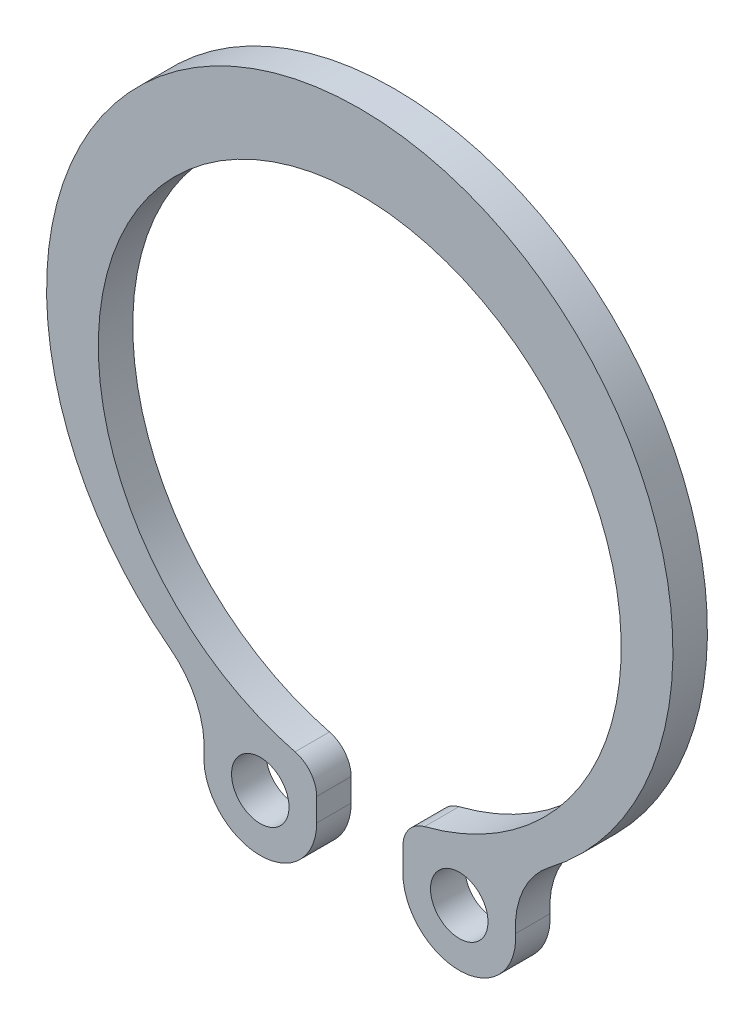
ISO-10303-21;
HEADER;
FILE_DESCRIPTION(('STEP AP214'),'2;1');
FILE_NAME('part.step','',(''),(''),'','','');
FILE_SCHEMA(('AUTOMOTIVE_DESIGN { 1 0 10303 214 1 1 1 1 }'));
ENDSEC;
DATA;
#1=APPLICATION_CONTEXT('core data for automotive mechanical design processes');
#2=APPLICATION_PROTOCOL_DEFINITION('international standard','automotive_design',2000,#1);
#3=PRODUCT_CONTEXT('',#1,'mechanical');
#4=PRODUCT('Part','Part','',(#3));
#5=PRODUCT_RELATED_PRODUCT_CATEGORY('part','',(#4));
#6=PRODUCT_DEFINITION_FORMATION('','',#4);
#7=PRODUCT_DEFINITION_CONTEXT('part definition',#1,'design');
#8=PRODUCT_DEFINITION('design','',#6,#7);
#9=PRODUCT_DEFINITION_SHAPE('','',#8);
#10=(LENGTH_UNIT() NAMED_UNIT(*) SI_UNIT(.MILLI.,.METRE.));
#11=(NAMED_UNIT(*) PLANE_ANGLE_UNIT() SI_UNIT($,.RADIAN.));
#12=(NAMED_UNIT(*) SI_UNIT($,.STERADIAN.) SOLID_ANGLE_UNIT());
#13=UNCERTAINTY_MEASURE_WITH_UNIT(LENGTH_MEASURE(1.E-05),#10,'distance_accuracy_value','');
#14=(GEOMETRIC_REPRESENTATION_CONTEXT(3) GLOBAL_UNCERTAINTY_ASSIGNED_CONTEXT((#13)) GLOBAL_UNIT_ASSIGNED_CONTEXT((#10,
#11,#12)) REPRESENTATION_CONTEXT('',''));
#15=CARTESIAN_POINT('',(0.,0.,0.));
#16=DIRECTION('',(0.,0.,1.));
#17=DIRECTION('',(1.,0.,0.));
#18=AXIS2_PLACEMENT_3D('',#15,#16,#17);
#19=CARTESIAN_POINT('',(2.5,-10.5857038581801,1.2));
#20=DIRECTION('',(0.,0.,1.));
#21=DIRECTION('',(1.,0.,0.));
#22=AXIS2_PLACEMENT_3D('',#19,#20,#21);
#23=PLANE('',#22);
#24=CARTESIAN_POINT('',(-3.46294408179002,-11.384990921665,1.2));
#25=DIRECTION('',(0.,0.,1.));
#26=DIRECTION('',(1.,0.,0.));
#27=AXIS2_PLACEMENT_3D('',#24,#25,#26);
#28=CIRCLE('',#27,1.);
#29=CARTESIAN_POINT('',(-2.46294408179002,-11.384990921665,1.2));
#30=VERTEX_POINT('',#29);
#31=EDGE_CURVE('E148',#30,#30,#28,.T.);
#32=ORIENTED_EDGE('',*,*,#31,.F.);
#33=EDGE_LOOP('',(#32));
#34=FACE_BOUND('',#33,.T.);
#35=CARTESIAN_POINT('',(2.5,-10.5857038581801,1.2));
#36=DIRECTION('',(0.,0.,1.));
#37=DIRECTION('',(1.,0.,0.));
#38=AXIS2_PLACEMENT_3D('',#35,#36,#37);
#39=CIRCLE('',#38,1.);
#40=CARTESIAN_POINT('',(2.25247524752475,-9.61682228806322,1.2));
#41=VERTEX_POINT('',#40);
#42=CARTESIAN_POINT('',(1.5,-10.5857038581801,1.2));
#43=VERTEX_POINT('',#42);
#44=EDGE_CURVE('E163',#41,#43,#39,.T.);
#45=ORIENTED_EDGE('',*,*,#44,.T.);
#46=DIRECTION('',(0.,-1.,0.));
#47=VECTOR('',#46,1.);
#48=CARTESIAN_POINT('',(1.5,-11.384990921665,1.2));
#49=LINE('',#48,#47);
#50=CARTESIAN_POINT('',(1.5,-11.384990921665,1.2));
#51=VERTEX_POINT('',#50);
#52=EDGE_CURVE('E101',#43,#51,#49,.T.);
#53=ORIENTED_EDGE('',*,*,#52,.T.);
#54=CARTESIAN_POINT('',(3.46294408179002,-11.384990921665,1.2));
#55=DIRECTION('',(0.,0.,1.));
#56=DIRECTION('',(-1.,0.,0.));
#57=AXIS2_PLACEMENT_3D('',#54,#55,#56);
#58=CIRCLE('',#57,1.96294408179002);
#59=CARTESIAN_POINT('',(5.42175310410235,-11.2576461834845,1.2));
#60=VERTEX_POINT('',#59);
#61=EDGE_CURVE('E184',#51,#60,#58,.T.);
#62=ORIENTED_EDGE('',*,*,#61,.T.);
#63=CARTESIAN_POINT('',(8.41543342411343,-11.063023107827,1.2));
#64=DIRECTION('',(0.,0.,-1.));
#65=DIRECTION('',(1.,0.,0.));
#66=AXIS2_PLACEMENT_3D('',#63,#64,#65);
#67=CIRCLE('',#66,3.);
#68=CARTESIAN_POINT('',(6.59915282898103,-8.6753202787996,1.2));
#69=VERTEX_POINT('',#68);
#70=EDGE_CURVE('E203',#60,#69,#67,.T.);
#71=ORIENTED_EDGE('',*,*,#70,.T.);
#72=CARTESIAN_POINT('',(0.,0.,1.2));
#73=DIRECTION('',(0.,0.,1.));
#74=DIRECTION('',(1.,0.,0.));
#75=AXIS2_PLACEMENT_3D('',#72,#73,#74);
#76=CIRCLE('',#75,10.9);
#77=CARTESIAN_POINT('',(-6.59915282898103,-8.6753202787996,1.2));
#78=VERTEX_POINT('',#77);
#79=EDGE_CURVE('E200',#69,#78,#76,.T.);
#80=ORIENTED_EDGE('',*,*,#79,.T.);
#81=CARTESIAN_POINT('',(-8.41543342411343,-11.063023107827,1.2));
#82=DIRECTION('',(0.,0.,-1.));
#83=DIRECTION('',(-1.,0.,0.));
#84=AXIS2_PLACEMENT_3D('',#81,#82,#83);
#85=CIRCLE('',#84,3.);
#86=CARTESIAN_POINT('',(-5.42175310410235,-11.2576461834845,1.2));
#87=VERTEX_POINT('',#86);
#88=EDGE_CURVE('E202',#78,#87,#85,.T.);
#89=ORIENTED_EDGE('',*,*,#88,.T.);
#90=CARTESIAN_POINT('',(-3.46294408179002,-11.384990921665,1.2));
#91=DIRECTION('',(0.,0.,1.));
#92=DIRECTION('',(1.,0.,0.));
#93=AXIS2_PLACEMENT_3D('',#90,#91,#92);
#94=CIRCLE('',#93,1.96294408179002);
#95=CARTESIAN_POINT('',(-1.5,-11.384990921665,1.2));
#96=VERTEX_POINT('',#95);
#97=EDGE_CURVE('E126',#87,#96,#94,.T.);
#98=ORIENTED_EDGE('',*,*,#97,.T.);
#99=DIRECTION('',(0.,1.,0.));
#100=VECTOR('',#99,1.);
#101=CARTESIAN_POINT('',(-1.5,-11.384990921665,1.2));
#102=LINE('',#101,#100);
#103=CARTESIAN_POINT('',(-1.5,-10.5857038581801,1.2));
#104=VERTEX_POINT('',#103);
#105=EDGE_CURVE('E120',#96,#104,#102,.T.);
#106=ORIENTED_EDGE('',*,*,#105,.T.);
#107=CARTESIAN_POINT('',(-2.5,-10.5857038581801,1.2));
#108=DIRECTION('',(0.,0.,1.));
#109=DIRECTION('',(-1.,0.,0.));
#110=AXIS2_PLACEMENT_3D('',#107,#108,#109);
#111=CIRCLE('',#110,1.);
#112=CARTESIAN_POINT('',(-2.25247524752476,-9.61682228806322,1.2));
#113=VERTEX_POINT('',#112);
#114=EDGE_CURVE('E124',#104,#113,#111,.T.);
#115=ORIENTED_EDGE('',*,*,#114,.T.);
#116=CARTESIAN_POINT('',(0.,-0.8,1.2));
#117=DIRECTION('',(0.,0.,-1.));
#118=DIRECTION('',(1.,0.,0.));
#119=AXIS2_PLACEMENT_3D('',#116,#117,#118);
#120=CIRCLE('',#119,9.1);
#121=EDGE_CURVE('E52',#113,#41,#120,.T.);
#122=ORIENTED_EDGE('',*,*,#121,.T.);
#123=EDGE_LOOP('',(#45,#53,#62,#71,#80,#89,#98,#106,#115,#122));
#124=FACE_BOUND('',#123,.T.);
#125=CARTESIAN_POINT('',(3.46294408179002,-11.384990921665,1.2));
#126=DIRECTION('',(0.,0.,1.));
#127=DIRECTION('',(-1.,0.,0.));
#128=AXIS2_PLACEMENT_3D('',#125,#126,#127);
#129=CIRCLE('',#128,0.999999999999999);
#130=CARTESIAN_POINT('',(2.46294408179002,-11.384990921665,1.2));
#131=VERTEX_POINT('',#130);
#132=EDGE_CURVE('E214',#131,#131,#129,.T.);
#133=ORIENTED_EDGE('',*,*,#132,.F.);
#134=EDGE_LOOP('',(#133));
#135=FACE_BOUND('',#134,.T.);
#136=ADVANCED_FACE('F35',(#34,#124,#135),#23,.T.);
#137=CARTESIAN_POINT('',(2.5,-10.5857038581801,0.));
#138=DIRECTION('',(0.,0.,1.));
#139=DIRECTION('',(1.,0.,0.));
#140=AXIS2_PLACEMENT_3D('',#137,#138,#139);
#141=PLANE('',#140);
#142=CARTESIAN_POINT('',(2.5,-10.5857038581801,0.));
#143=DIRECTION('',(0.,0.,1.));
#144=DIRECTION('',(1.,0.,0.));
#145=AXIS2_PLACEMENT_3D('',#142,#143,#144);
#146=CIRCLE('',#145,1.);
#147=CARTESIAN_POINT('',(2.25247524752475,-9.61682228806322,0.));
#148=VERTEX_POINT('',#147);
#149=CARTESIAN_POINT('',(1.5,-10.5857038581801,0.));
#150=VERTEX_POINT('',#149);
#151=EDGE_CURVE('E144',#148,#150,#146,.T.);
#152=ORIENTED_EDGE('',*,*,#151,.F.);
#153=CARTESIAN_POINT('',(0.,-0.8,0.));
#154=DIRECTION('',(0.,0.,-1.));
#155=DIRECTION('',(1.,0.,0.));
#156=AXIS2_PLACEMENT_3D('',#153,#154,#155);
#157=CIRCLE('',#156,9.1);
#158=CARTESIAN_POINT('',(-2.25247524752476,-9.61682228806322,0.));
#159=VERTEX_POINT('',#158);
#160=EDGE_CURVE('E93',#159,#148,#157,.T.);
#161=ORIENTED_EDGE('',*,*,#160,.F.);
#162=CARTESIAN_POINT('',(-2.5,-10.5857038581801,0.));
#163=DIRECTION('',(0.,0.,1.));
#164=DIRECTION('',(-1.,0.,0.));
#165=AXIS2_PLACEMENT_3D('',#162,#163,#164);
#166=CIRCLE('',#165,1.);
#167=CARTESIAN_POINT('',(-1.5,-10.5857038581801,0.));
#168=VERTEX_POINT('',#167);
#169=EDGE_CURVE('E87',#168,#159,#166,.T.);
#170=ORIENTED_EDGE('',*,*,#169,.F.);
#171=DIRECTION('',(0.,1.,0.));
#172=VECTOR('',#171,1.);
#173=CARTESIAN_POINT('',(-1.5,-11.384990921665,0.));
#174=LINE('',#173,#172);
#175=CARTESIAN_POINT('',(-1.5,-11.384990921665,0.));
#176=VERTEX_POINT('',#175);
#177=EDGE_CURVE('E134',#176,#168,#174,.T.);
#178=ORIENTED_EDGE('',*,*,#177,.F.);
#179=CARTESIAN_POINT('',(-3.46294408179002,-11.384990921665,0.));
#180=DIRECTION('',(0.,0.,1.));
#181=DIRECTION('',(1.,0.,0.));
#182=AXIS2_PLACEMENT_3D('',#179,#180,#181);
#183=CIRCLE('',#182,1.96294408179002);
#184=CARTESIAN_POINT('',(-5.42175310410235,-11.2576461834845,0.));
#185=VERTEX_POINT('',#184);
#186=EDGE_CURVE('E158',#185,#176,#183,.T.);
#187=ORIENTED_EDGE('',*,*,#186,.F.);
#188=CARTESIAN_POINT('',(-8.41543342411343,-11.063023107827,0.));
#189=DIRECTION('',(0.,0.,-1.));
#190=DIRECTION('',(-1.,0.,0.));
#191=AXIS2_PLACEMENT_3D('',#188,#189,#190);
#192=CIRCLE('',#191,3.);
#193=CARTESIAN_POINT('',(-6.59915282898103,-8.6753202787996,0.));
#194=VERTEX_POINT('',#193);
#195=EDGE_CURVE('E156',#194,#185,#192,.T.);
#196=ORIENTED_EDGE('',*,*,#195,.F.);
#197=CARTESIAN_POINT('',(0.,0.,0.));
#198=DIRECTION('',(0.,0.,1.));
#199=DIRECTION('',(1.,0.,0.));
#200=AXIS2_PLACEMENT_3D('',#197,#198,#199);
#201=CIRCLE('',#200,10.9);
#202=CARTESIAN_POINT('',(6.59915282898103,-8.6753202787996,0.));
#203=VERTEX_POINT('',#202);
#204=EDGE_CURVE('E154',#203,#194,#201,.T.);
#205=ORIENTED_EDGE('',*,*,#204,.F.);
#206=CARTESIAN_POINT('',(8.41543342411343,-11.063023107827,0.));
#207=DIRECTION('',(0.,0.,-1.));
#208=DIRECTION('',(1.,0.,0.));
#209=AXIS2_PLACEMENT_3D('',#206,#207,#208);
#210=CIRCLE('',#209,3.);
#211=CARTESIAN_POINT('',(5.42175310410235,-11.2576461834845,0.));
#212=VERTEX_POINT('',#211);
#213=EDGE_CURVE('E152',#212,#203,#210,.T.);
#214=ORIENTED_EDGE('',*,*,#213,.F.);
#215=CARTESIAN_POINT('',(3.46294408179002,-11.384990921665,0.));
#216=DIRECTION('',(0.,0.,1.));
#217=DIRECTION('',(-1.,0.,0.));
#218=AXIS2_PLACEMENT_3D('',#215,#216,#217);
#219=CIRCLE('',#218,1.96294408179002);
#220=CARTESIAN_POINT('',(1.5,-11.384990921665,0.));
#221=VERTEX_POINT('',#220);
#222=EDGE_CURVE('E150',#221,#212,#219,.T.);
#223=ORIENTED_EDGE('',*,*,#222,.F.);
#224=DIRECTION('',(0.,-1.,0.));
#225=VECTOR('',#224,1.);
#226=CARTESIAN_POINT('',(1.5,-11.384990921665,0.));
#227=LINE('',#226,#225);
#228=EDGE_CURVE('E147',#150,#221,#227,.T.);
#229=ORIENTED_EDGE('',*,*,#228,.F.);
#230=EDGE_LOOP('',(#152,#161,#170,#178,#187,#196,#205,#214,#223,#229));
#231=FACE_BOUND('',#230,.T.);
#232=CARTESIAN_POINT('',(-3.46294408179002,-11.384990921665,0.));
#233=DIRECTION('',(0.,0.,1.));
#234=DIRECTION('',(1.,0.,0.));
#235=AXIS2_PLACEMENT_3D('',#232,#233,#234);
#236=CIRCLE('',#235,1.);
#237=CARTESIAN_POINT('',(-2.46294408179002,-11.384990921665,0.));
#238=VERTEX_POINT('',#237);
#239=EDGE_CURVE('E211',#238,#238,#236,.T.);
#240=ORIENTED_EDGE('',*,*,#239,.T.);
#241=EDGE_LOOP('',(#240));
#242=FACE_BOUND('',#241,.T.);
#243=CARTESIAN_POINT('',(3.46294408179002,-11.384990921665,0.));
#244=DIRECTION('',(0.,0.,1.));
#245=DIRECTION('',(-1.,0.,0.));
#246=AXIS2_PLACEMENT_3D('',#243,#244,#245);
#247=CIRCLE('',#246,0.999999999999999);
#248=CARTESIAN_POINT('',(2.46294408179002,-11.384990921665,0.));
#249=VERTEX_POINT('',#248);
#250=EDGE_CURVE('E217',#249,#249,#247,.T.);
#251=ORIENTED_EDGE('',*,*,#250,.T.);
#252=EDGE_LOOP('',(#251));
#253=FACE_BOUND('',#252,.T.);
#254=ADVANCED_FACE('F188',(#231,#242,#253),#141,.F.);
#255=CARTESIAN_POINT('',(2.5,-10.5857038581801,1.2));
#256=DIRECTION('',(0.,0.,-1.));
#257=DIRECTION('',(-1.,0.,0.));
#258=AXIS2_PLACEMENT_3D('',#255,#256,#257);
#259=CYLINDRICAL_SURFACE('',#258,1.);
#260=ORIENTED_EDGE('',*,*,#151,.T.);
#261=DIRECTION('',(0.,0.,-1.));
#262=VECTOR('',#261,1.);
#263=CARTESIAN_POINT('',(1.5,-10.5857038581801,1.2));
#264=LINE('',#263,#262);
#265=EDGE_CURVE('E11',#43,#150,#264,.T.);
#266=ORIENTED_EDGE('',*,*,#265,.F.);
#267=ORIENTED_EDGE('',*,*,#44,.F.);
#268=DIRECTION('',(0.,0.,-1.));
#269=VECTOR('',#268,1.);
#270=CARTESIAN_POINT('',(2.25247524752475,-9.61682228806322,1.2));
#271=LINE('',#270,#269);
#272=EDGE_CURVE('E140',#41,#148,#271,.T.);
#273=ORIENTED_EDGE('',*,*,#272,.T.);
#274=EDGE_LOOP('',(#260,#266,#267,#273));
#275=FACE_BOUND('',#274,.T.);
#276=ADVANCED_FACE('F37',(#275),#259,.T.);
#277=CARTESIAN_POINT('',(1.5,-11.384990921665,1.2));
#278=DIRECTION('',(1.,0.,0.));
#279=DIRECTION('',(0.,0.,-1.));
#280=AXIS2_PLACEMENT_3D('',#277,#278,#279);
#281=PLANE('',#280);
#282=ORIENTED_EDGE('',*,*,#228,.T.);
#283=DIRECTION('',(0.,0.,-1.));
#284=VECTOR('',#283,1.);
#285=CARTESIAN_POINT('',(1.5,-11.384990921665,1.2));
#286=LINE('',#285,#284);
#287=EDGE_CURVE('E44',#51,#221,#286,.T.);
#288=ORIENTED_EDGE('',*,*,#287,.F.);
#289=ORIENTED_EDGE('',*,*,#52,.F.);
#290=ORIENTED_EDGE('',*,*,#265,.T.);
#291=EDGE_LOOP('',(#282,#288,#289,#290));
#292=FACE_BOUND('',#291,.T.);
#293=ADVANCED_FACE('F257',(#292),#281,.F.);
#294=CARTESIAN_POINT('',(3.46294408179002,-11.384990921665,1.2));
#295=DIRECTION('',(0.,0.,-1.));
#296=DIRECTION('',(-1.,0.,0.));
#297=AXIS2_PLACEMENT_3D('',#294,#295,#296);
#298=CYLINDRICAL_SURFACE('',#297,1.96294408179002);
#299=ORIENTED_EDGE('',*,*,#222,.T.);
#300=DIRECTION('',(0.,0.,-1.));
#301=VECTOR('',#300,1.);
#302=CARTESIAN_POINT('',(5.42175310410235,-11.2576461834845,1.2));
#303=LINE('',#302,#301);
#304=EDGE_CURVE('E176',#60,#212,#303,.T.);
#305=ORIENTED_EDGE('',*,*,#304,.F.);
#306=ORIENTED_EDGE('',*,*,#61,.F.);
#307=ORIENTED_EDGE('',*,*,#287,.T.);
#308=EDGE_LOOP('',(#299,#305,#306,#307));
#309=FACE_BOUND('',#308,.T.);
#310=ADVANCED_FACE('F182',(#309),#298,.T.);
#311=CARTESIAN_POINT('',(8.41543342411343,-11.063023107827,1.2));
#312=DIRECTION('',(0.,0.,-1.));
#313=DIRECTION('',(-1.,0.,0.));
#314=AXIS2_PLACEMENT_3D('',#311,#312,#313);
#315=CYLINDRICAL_SURFACE('',#314,3.);
#316=ORIENTED_EDGE('',*,*,#213,.T.);
#317=DIRECTION('',(0.,0.,-1.));
#318=VECTOR('',#317,1.);
#319=CARTESIAN_POINT('',(6.59915282898103,-8.6753202787996,1.2));
#320=LINE('',#319,#318);
#321=EDGE_CURVE('E173',#69,#203,#320,.T.);
#322=ORIENTED_EDGE('',*,*,#321,.F.);
#323=ORIENTED_EDGE('',*,*,#70,.F.);
#324=ORIENTED_EDGE('',*,*,#304,.T.);
#325=EDGE_LOOP('',(#316,#322,#323,#324));
#326=FACE_BOUND('',#325,.T.);
#327=ADVANCED_FACE('F194',(#326),#315,.F.);
#328=CARTESIAN_POINT('',(0.,0.,1.2));
#329=DIRECTION('',(0.,0.,-1.));
#330=DIRECTION('',(-1.,0.,0.));
#331=AXIS2_PLACEMENT_3D('',#328,#329,#330);
#332=CYLINDRICAL_SURFACE('',#331,10.9);
#333=ORIENTED_EDGE('',*,*,#204,.T.);
#334=DIRECTION('',(0.,0.,-1.));
#335=VECTOR('',#334,1.);
#336=CARTESIAN_POINT('',(-6.59915282898103,-8.6753202787996,1.2));
#337=LINE('',#336,#335);
#338=EDGE_CURVE('E170',#78,#194,#337,.T.);
#339=ORIENTED_EDGE('',*,*,#338,.F.);
#340=ORIENTED_EDGE('',*,*,#79,.F.);
#341=ORIENTED_EDGE('',*,*,#321,.T.);
#342=EDGE_LOOP('',(#333,#339,#340,#341));
#343=FACE_BOUND('',#342,.T.);
#344=ADVANCED_FACE('F198',(#343),#332,.T.);
#345=CARTESIAN_POINT('',(-8.41543342411343,-11.063023107827,1.2));
#346=DIRECTION('',(0.,0.,-1.));
#347=DIRECTION('',(-1.,0.,0.));
#348=AXIS2_PLACEMENT_3D('',#345,#346,#347);
#349=CYLINDRICAL_SURFACE('',#348,3.);
#350=ORIENTED_EDGE('',*,*,#195,.T.);
#351=DIRECTION('',(0.,0.,-1.));
#352=VECTOR('',#351,1.);
#353=CARTESIAN_POINT('',(-5.42175310410235,-11.2576461834845,1.2));
#354=LINE('',#353,#352);
#355=EDGE_CURVE('E167',#87,#185,#354,.T.);
#356=ORIENTED_EDGE('',*,*,#355,.F.);
#357=ORIENTED_EDGE('',*,*,#88,.F.);
#358=ORIENTED_EDGE('',*,*,#338,.T.);
#359=EDGE_LOOP('',(#350,#356,#357,#358));
#360=FACE_BOUND('',#359,.T.);
#361=ADVANCED_FACE('F247',(#360),#349,.F.);
#362=CARTESIAN_POINT('',(-3.46294408179002,-11.384990921665,1.2));
#363=DIRECTION('',(0.,0.,-1.));
#364=DIRECTION('',(-1.,0.,0.));
#365=AXIS2_PLACEMENT_3D('',#362,#363,#364);
#366=CYLINDRICAL_SURFACE('',#365,1.96294408179002);
#367=ORIENTED_EDGE('',*,*,#186,.T.);
#368=DIRECTION('',(0.,0.,-1.));
#369=VECTOR('',#368,1.);
#370=CARTESIAN_POINT('',(-1.5,-11.384990921665,1.2));
#371=LINE('',#370,#369);
#372=EDGE_CURVE('E135',#96,#176,#371,.T.);
#373=ORIENTED_EDGE('',*,*,#372,.F.);
#374=ORIENTED_EDGE('',*,*,#97,.F.);
#375=ORIENTED_EDGE('',*,*,#355,.T.);
#376=EDGE_LOOP('',(#367,#373,#374,#375));
#377=FACE_BOUND('',#376,.T.);
#378=ADVANCED_FACE('F244',(#377),#366,.T.);
#379=CARTESIAN_POINT('',(-1.5,-11.384990921665,1.2));
#380=DIRECTION('',(-1.,0.,0.));
#381=DIRECTION('',(0.,0.,1.));
#382=AXIS2_PLACEMENT_3D('',#379,#380,#381);
#383=PLANE('',#382);
#384=ORIENTED_EDGE('',*,*,#177,.T.);
#385=DIRECTION('',(0.,0.,-1.));
#386=VECTOR('',#385,1.);
#387=CARTESIAN_POINT('',(-1.5,-10.5857038581801,1.2));
#388=LINE('',#387,#386);
#389=EDGE_CURVE('E131',#104,#168,#388,.T.);
#390=ORIENTED_EDGE('',*,*,#389,.F.);
#391=ORIENTED_EDGE('',*,*,#105,.F.);
#392=ORIENTED_EDGE('',*,*,#372,.T.);
#393=EDGE_LOOP('',(#384,#390,#391,#392));
#394=FACE_BOUND('',#393,.T.);
#395=ADVANCED_FACE('F132',(#394),#383,.F.);
#396=CARTESIAN_POINT('',(-2.5,-10.5857038581801,1.2));
#397=DIRECTION('',(0.,0.,-1.));
#398=DIRECTION('',(-1.,0.,0.));
#399=AXIS2_PLACEMENT_3D('',#396,#397,#398);
#400=CYLINDRICAL_SURFACE('',#399,1.);
#401=ORIENTED_EDGE('',*,*,#169,.T.);
#402=DIRECTION('',(0.,0.,-1.));
#403=VECTOR('',#402,1.);
#404=CARTESIAN_POINT('',(-2.25247524752476,-9.61682228806322,1.2));
#405=LINE('',#404,#403);
#406=EDGE_CURVE('E136',#113,#159,#405,.T.);
#407=ORIENTED_EDGE('',*,*,#406,.F.);
#408=ORIENTED_EDGE('',*,*,#114,.F.);
#409=ORIENTED_EDGE('',*,*,#389,.T.);
#410=EDGE_LOOP('',(#401,#407,#408,#409));
#411=FACE_BOUND('',#410,.T.);
#412=ADVANCED_FACE('F138',(#411),#400,.T.);
#413=CARTESIAN_POINT('',(0.,-0.8,1.2));
#414=DIRECTION('',(0.,0.,-1.));
#415=DIRECTION('',(-1.,0.,0.));
#416=AXIS2_PLACEMENT_3D('',#413,#414,#415);
#417=CYLINDRICAL_SURFACE('',#416,9.1);
#418=ORIENTED_EDGE('',*,*,#160,.T.);
#419=ORIENTED_EDGE('',*,*,#272,.F.);
#420=ORIENTED_EDGE('',*,*,#121,.F.);
#421=ORIENTED_EDGE('',*,*,#406,.T.);
#422=EDGE_LOOP('',(#418,#419,#420,#421));
#423=FACE_BOUND('',#422,.T.);
#424=ADVANCED_FACE('F237',(#423),#417,.F.);
#425=CARTESIAN_POINT('',(-3.46294408179002,-11.384990921665,1.2));
#426=DIRECTION('',(0.,0.,-1.));
#427=DIRECTION('',(-1.,0.,0.));
#428=AXIS2_PLACEMENT_3D('',#425,#426,#427);
#429=CYLINDRICAL_SURFACE('',#428,1.);
#430=ORIENTED_EDGE('',*,*,#31,.T.);
#431=EDGE_LOOP('',(#430));
#432=FACE_BOUND('',#431,.T.);
#433=ORIENTED_EDGE('',*,*,#239,.F.);
#434=EDGE_LOOP('',(#433));
#435=FACE_BOUND('',#434,.T.);
#436=ADVANCED_FACE('F234',(#432,#435),#429,.F.);
#437=CARTESIAN_POINT('',(3.46294408179002,-11.384990921665,1.2));
#438=DIRECTION('',(0.,0.,-1.));
#439=DIRECTION('',(-1.,0.,0.));
#440=AXIS2_PLACEMENT_3D('',#437,#438,#439);
#441=CYLINDRICAL_SURFACE('',#440,0.999999999999999);
#442=ORIENTED_EDGE('',*,*,#132,.T.);
#443=EDGE_LOOP('',(#442));
#444=FACE_BOUND('',#443,.T.);
#445=ORIENTED_EDGE('',*,*,#250,.F.);
#446=EDGE_LOOP('',(#445));
#447=FACE_BOUND('',#446,.T.);
#448=ADVANCED_FACE('F223',(#444,#447),#441,.F.);
#449=CLOSED_SHELL('',(#136,#254,#276,#293,#310,#327,#344,#361,#378,#395,#412,#424,#436,#448));
#450=MANIFOLD_SOLID_BREP('B2',#449);
#451=ADVANCED_BREP_SHAPE_REPRESENTATION('',(#18,#450),#14);
#452=SHAPE_DEFINITION_REPRESENTATION(#9,#451);
ENDSEC;
END-ISO-10303-21;
